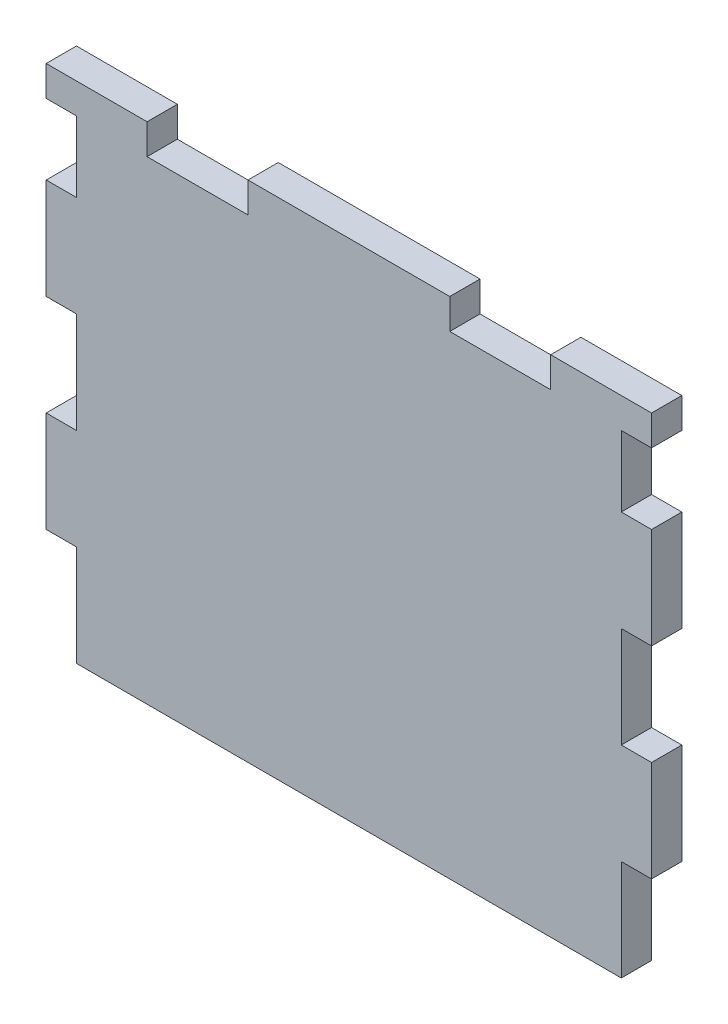
ISO-10303-21;
HEADER;
FILE_DESCRIPTION(('STEP AP214'),'2;1');
FILE_NAME('part.step','',(''),(''),'','','');
FILE_SCHEMA(('AUTOMOTIVE_DESIGN { 1 0 10303 214 1 1 1 1 }'));
ENDSEC;
DATA;
#1=APPLICATION_CONTEXT('core data for automotive mechanical design processes');
#2=APPLICATION_PROTOCOL_DEFINITION('international standard','automotive_design',2000,#1);
#3=PRODUCT_CONTEXT('',#1,'mechanical');
#4=PRODUCT('Part','Part','',(#3));
#5=PRODUCT_RELATED_PRODUCT_CATEGORY('part','',(#4));
#6=PRODUCT_DEFINITION_FORMATION('','',#4);
#7=PRODUCT_DEFINITION_CONTEXT('part definition',#1,'design');
#8=PRODUCT_DEFINITION('design','',#6,#7);
#9=PRODUCT_DEFINITION_SHAPE('','',#8);
#10=(LENGTH_UNIT() NAMED_UNIT(*) SI_UNIT(.MILLI.,.METRE.));
#11=(NAMED_UNIT(*) PLANE_ANGLE_UNIT() SI_UNIT($,.RADIAN.));
#12=(NAMED_UNIT(*) SI_UNIT($,.STERADIAN.) SOLID_ANGLE_UNIT());
#13=UNCERTAINTY_MEASURE_WITH_UNIT(LENGTH_MEASURE(1.E-05),#10,'distance_accuracy_value','');
#14=(GEOMETRIC_REPRESENTATION_CONTEXT(3) GLOBAL_UNCERTAINTY_ASSIGNED_CONTEXT((#13)) GLOBAL_UNIT_ASSIGNED_CONTEXT((#10,
#11,#12)) REPRESENTATION_CONTEXT('',''));
#15=CARTESIAN_POINT('',(0.,0.,0.));
#16=DIRECTION('',(0.,0.,1.));
#17=DIRECTION('',(1.,0.,0.));
#18=AXIS2_PLACEMENT_3D('',#15,#16,#17);
#19=CARTESIAN_POINT('',(-30.,-25.,3.));
#20=DIRECTION('',(0.,1.,0.));
#21=DIRECTION('',(0.,0.,1.));
#22=AXIS2_PLACEMENT_3D('',#19,#20,#21);
#23=PLANE('',#22);
#24=DIRECTION('',(1.,0.,0.));
#25=VECTOR('',#24,1.);
#26=CARTESIAN_POINT('',(-30.,-25.,3.));
#27=LINE('',#26,#25);
#28=CARTESIAN_POINT('',(-26.9999999999999,-25.0000000000001,3.00000000000097));
#29=VERTEX_POINT('',#28);
#30=CARTESIAN_POINT('',(26.9999999999997,-24.9999999999999,3.00000000000097));
#31=VERTEX_POINT('',#30);
#32=EDGE_CURVE('E251',#29,#31,#27,.T.);
#33=ORIENTED_EDGE('',*,*,#32,.F.);
#34=DIRECTION('',(0.,0.,-1.));
#35=VECTOR('',#34,1.);
#36=CARTESIAN_POINT('',(-26.9999999999999,-25.,-1.14491749414469E-13));
#37=LINE('',#36,#35);
#38=CARTESIAN_POINT('',(-26.9999999999999,-25.,-1.14491749414469E-13));
#39=VERTEX_POINT('',#38);
#40=EDGE_CURVE('E261',#29,#39,#37,.T.);
#41=ORIENTED_EDGE('',*,*,#40,.T.);
#42=DIRECTION('',(1.,0.,0.));
#43=VECTOR('',#42,1.);
#44=CARTESIAN_POINT('',(-30.,-25.,0.));
#45=LINE('',#44,#43);
#46=CARTESIAN_POINT('',(27.0000000000001,-24.9999999999999,-1.14491749414469E-13));
#47=VERTEX_POINT('',#46);
#48=EDGE_CURVE('E299',#39,#47,#45,.T.);
#49=ORIENTED_EDGE('',*,*,#48,.T.);
#50=DIRECTION('',(0.,0.,-1.));
#51=VECTOR('',#50,1.);
#52=CARTESIAN_POINT('',(27.0000000000001,-24.9999999999999,-1.14491749414469E-13));
#53=LINE('',#52,#51);
#54=EDGE_CURVE('E272',#31,#47,#53,.T.);
#55=ORIENTED_EDGE('',*,*,#54,.F.);
#56=EDGE_LOOP('',(#33,#41,#49,#55));
#57=FACE_BOUND('',#56,.T.);
#58=ADVANCED_FACE('F37',(#57),#23,.F.);
#59=CARTESIAN_POINT('',(30.,-25.,3.));
#60=DIRECTION('',(-1.,0.,0.));
#61=DIRECTION('',(0.,0.,1.));
#62=AXIS2_PLACEMENT_3D('',#59,#60,#61);
#63=PLANE('',#62);
#64=DIRECTION('',(0.,1.,0.));
#65=VECTOR('',#64,1.);
#66=CARTESIAN_POINT('',(30.,-25.,3.));
#67=LINE('',#66,#65);
#68=CARTESIAN_POINT('',(30.0000000000001,-14.9999999999999,2.99999999999993));
#69=VERTEX_POINT('',#68);
#70=CARTESIAN_POINT('',(30.,-4.99999999999986,2.99999999999996));
#71=VERTEX_POINT('',#70);
#72=EDGE_CURVE('E392',#69,#71,#67,.T.);
#73=ORIENTED_EDGE('',*,*,#72,.F.);
#74=DIRECTION('',(0.,0.,-1.));
#75=VECTOR('',#74,1.);
#76=CARTESIAN_POINT('',(30.0000000000001,-14.9999999999999,0.));
#77=LINE('',#76,#75);
#78=CARTESIAN_POINT('',(30.0000000000001,-14.9999999999999,0.));
#79=VERTEX_POINT('',#78);
#80=EDGE_CURVE('E453',#69,#79,#77,.T.);
#81=ORIENTED_EDGE('',*,*,#80,.T.);
#82=DIRECTION('',(0.,1.,0.));
#83=VECTOR('',#82,1.);
#84=CARTESIAN_POINT('',(30.,-25.,0.));
#85=LINE('',#84,#83);
#86=CARTESIAN_POINT('',(30.,-4.99999999999985,0.));
#87=VERTEX_POINT('',#86);
#88=EDGE_CURVE('E289',#79,#87,#85,.T.);
#89=ORIENTED_EDGE('',*,*,#88,.T.);
#90=DIRECTION('',(0.,0.,1.));
#91=VECTOR('',#90,1.);
#92=CARTESIAN_POINT('',(30.,-4.99999999999985,0.));
#93=LINE('',#92,#91);
#94=EDGE_CURVE('E450',#87,#71,#93,.T.);
#95=ORIENTED_EDGE('',*,*,#94,.T.);
#96=EDGE_LOOP('',(#73,#81,#89,#95));
#97=FACE_BOUND('',#96,.T.);
#98=ADVANCED_FACE('F550',(#97),#63,.F.);
#99=CARTESIAN_POINT('',(30.,5.00000000000014,3.));
#100=VERTEX_POINT('',#99);
#101=CARTESIAN_POINT('',(30.,15.0000000000001,3.00000000000003));
#102=VERTEX_POINT('',#101);
#103=EDGE_CURVE('E391',#100,#102,#67,.T.);
#104=ORIENTED_EDGE('',*,*,#103,.F.);
#105=DIRECTION('',(0.,0.,-1.));
#106=VECTOR('',#105,1.);
#107=CARTESIAN_POINT('',(30.,5.00000000000015,0.));
#108=LINE('',#107,#106);
#109=CARTESIAN_POINT('',(30.,5.00000000000015,0.));
#110=VERTEX_POINT('',#109);
#111=EDGE_CURVE('E414',#100,#110,#108,.T.);
#112=ORIENTED_EDGE('',*,*,#111,.T.);
#113=CARTESIAN_POINT('',(30.,15.0000000000001,0.));
#114=VERTEX_POINT('',#113);
#115=EDGE_CURVE('E287',#110,#114,#85,.T.);
#116=ORIENTED_EDGE('',*,*,#115,.T.);
#117=DIRECTION('',(0.,0.,1.));
#118=VECTOR('',#117,1.);
#119=CARTESIAN_POINT('',(30.,15.0000000000001,0.));
#120=LINE('',#119,#118);
#121=EDGE_CURVE('E416',#114,#102,#120,.T.);
#122=ORIENTED_EDGE('',*,*,#121,.T.);
#123=EDGE_LOOP('',(#104,#112,#116,#122));
#124=FACE_BOUND('',#123,.T.);
#125=ADVANCED_FACE('F412',(#124),#63,.F.);
#126=CARTESIAN_POINT('',(-30.,-25.,3.));
#127=DIRECTION('',(1.,0.,0.));
#128=DIRECTION('',(0.,0.,-1.));
#129=AXIS2_PLACEMENT_3D('',#126,#127,#128);
#130=PLANE('',#129);
#131=DIRECTION('',(0.,0.,-1.));
#132=VECTOR('',#131,1.);
#133=CARTESIAN_POINT('',(-30.,21.9999999999999,0.));
#134=LINE('',#133,#132);
#135=CARTESIAN_POINT('',(-30.,21.9999999999999,3.));
#136=VERTEX_POINT('',#135);
#137=CARTESIAN_POINT('',(-30.,21.9999999999999,0.));
#138=VERTEX_POINT('',#137);
#139=EDGE_CURVE('E433',#136,#138,#134,.T.);
#140=ORIENTED_EDGE('',*,*,#139,.F.);
#141=DIRECTION('',(0.,-1.,0.));
#142=VECTOR('',#141,1.);
#143=CARTESIAN_POINT('',(-30.,-25.,3.));
#144=LINE('',#143,#142);
#145=CARTESIAN_POINT('',(-30.,25.,3.));
#146=VERTEX_POINT('',#145);
#147=EDGE_CURVE('E274',#146,#136,#144,.T.);
#148=ORIENTED_EDGE('',*,*,#147,.F.);
#149=DIRECTION('',(0.,0.,-1.));
#150=VECTOR('',#149,1.);
#151=CARTESIAN_POINT('',(-30.,25.,3.));
#152=LINE('',#151,#150);
#153=CARTESIAN_POINT('',(-30.,25.,0.));
#154=VERTEX_POINT('',#153);
#155=EDGE_CURVE('E273',#146,#154,#152,.T.);
#156=ORIENTED_EDGE('',*,*,#155,.T.);
#157=DIRECTION('',(0.,-1.,0.));
#158=VECTOR('',#157,1.);
#159=CARTESIAN_POINT('',(-30.,-25.,0.));
#160=LINE('',#159,#158);
#161=EDGE_CURVE('E296',#154,#138,#160,.T.);
#162=ORIENTED_EDGE('',*,*,#161,.T.);
#163=EDGE_LOOP('',(#140,#148,#156,#162));
#164=FACE_BOUND('',#163,.T.);
#165=ADVANCED_FACE('F560',(#164),#130,.F.);
#166=DIRECTION('',(0.,0.,1.));
#167=VECTOR('',#166,1.);
#168=CARTESIAN_POINT('',(-30.,14.9999999999999,0.));
#169=LINE('',#168,#167);
#170=CARTESIAN_POINT('',(-30.,14.9999999999999,0.));
#171=VERTEX_POINT('',#170);
#172=CARTESIAN_POINT('',(-30.,14.9999999999999,3.00000000000003));
#173=VERTEX_POINT('',#172);
#174=EDGE_CURVE('E472',#171,#173,#169,.T.);
#175=ORIENTED_EDGE('',*,*,#174,.F.);
#176=CARTESIAN_POINT('',(-30.,4.99999999999994,0.));
#177=VERTEX_POINT('',#176);
#178=EDGE_CURVE('E300',#171,#177,#160,.T.);
#179=ORIENTED_EDGE('',*,*,#178,.T.);
#180=DIRECTION('',(0.,0.,-1.));
#181=VECTOR('',#180,1.);
#182=CARTESIAN_POINT('',(-30.,4.99999999999994,0.));
#183=LINE('',#182,#181);
#184=CARTESIAN_POINT('',(-30.,4.99999999999993,3.));
#185=VERTEX_POINT('',#184);
#186=EDGE_CURVE('E475',#185,#177,#183,.T.);
#187=ORIENTED_EDGE('',*,*,#186,.F.);
#188=EDGE_CURVE('E280',#173,#185,#144,.T.);
#189=ORIENTED_EDGE('',*,*,#188,.F.);
#190=EDGE_LOOP('',(#175,#179,#187,#189));
#191=FACE_BOUND('',#190,.T.);
#192=ADVANCED_FACE('F531',(#191),#130,.F.);
#193=DIRECTION('',(0.,0.,1.));
#194=VECTOR('',#193,1.);
#195=CARTESIAN_POINT('',(-29.9999999999999,-5.00000000000006,0.));
#196=LINE('',#195,#194);
#197=CARTESIAN_POINT('',(-29.9999999999999,-5.00000000000006,0.));
#198=VERTEX_POINT('',#197);
#199=CARTESIAN_POINT('',(-29.9999999999999,-5.00000000000007,2.99999999999996));
#200=VERTEX_POINT('',#199);
#201=EDGE_CURVE('E489',#198,#200,#196,.T.);
#202=ORIENTED_EDGE('',*,*,#201,.F.);
#203=CARTESIAN_POINT('',(-29.9999999999999,-15.0000000000001,0.));
#204=VERTEX_POINT('',#203);
#205=EDGE_CURVE('E293',#198,#204,#160,.T.);
#206=ORIENTED_EDGE('',*,*,#205,.T.);
#207=DIRECTION('',(0.,0.,-1.));
#208=VECTOR('',#207,1.);
#209=CARTESIAN_POINT('',(-29.9999999999999,-15.0000000000001,0.));
#210=LINE('',#209,#208);
#211=CARTESIAN_POINT('',(-29.9999999999999,-15.0000000000001,2.99999999999993));
#212=VERTEX_POINT('',#211);
#213=EDGE_CURVE('E492',#212,#204,#210,.T.);
#214=ORIENTED_EDGE('',*,*,#213,.F.);
#215=EDGE_CURVE('E282',#200,#212,#144,.T.);
#216=ORIENTED_EDGE('',*,*,#215,.F.);
#217=EDGE_LOOP('',(#202,#206,#214,#216));
#218=FACE_BOUND('',#217,.T.);
#219=ADVANCED_FACE('F536',(#218),#130,.F.);
#220=CARTESIAN_POINT('',(0.,0.,3.));
#221=DIRECTION('',(0.,0.,-1.));
#222=DIRECTION('',(-1.,0.,0.));
#223=AXIS2_PLACEMENT_3D('',#220,#221,#222);
#224=PLANE('',#223);
#225=DIRECTION('',(0.,1.,0.));
#226=VECTOR('',#225,1.);
#227=CARTESIAN_POINT('',(-27.,0.,3.));
#228=LINE('',#227,#226);
#229=CARTESIAN_POINT('',(-26.9999999999999,-15.0000000000001,2.99999999999993));
#230=VERTEX_POINT('',#229);
#231=EDGE_CURVE('E246',#29,#230,#228,.T.);
#232=ORIENTED_EDGE('',*,*,#231,.F.);
#233=ORIENTED_EDGE('',*,*,#32,.T.);
#234=DIRECTION('',(0.,1.,0.));
#235=VECTOR('',#234,1.);
#236=CARTESIAN_POINT('',(27.,0.,3.));
#237=LINE('',#236,#235);
#238=CARTESIAN_POINT('',(27.0000000000001,-14.9999999999999,3.));
#239=VERTEX_POINT('',#238);
#240=EDGE_CURVE('E329',#31,#239,#237,.T.);
#241=ORIENTED_EDGE('',*,*,#240,.T.);
#242=DIRECTION('',(1.,0.,0.));
#243=VECTOR('',#242,1.);
#244=CARTESIAN_POINT('',(27.0000000000001,-14.9999999999999,2.99999999999993));
#245=LINE('',#244,#243);
#246=EDGE_CURVE('E465',#239,#69,#245,.T.);
#247=ORIENTED_EDGE('',*,*,#246,.T.);
#248=ORIENTED_EDGE('',*,*,#72,.T.);
#249=DIRECTION('',(1.,0.,0.));
#250=VECTOR('',#249,1.);
#251=CARTESIAN_POINT('',(27.,-4.99999999999987,2.99999999999996));
#252=LINE('',#251,#250);
#253=CARTESIAN_POINT('',(27.,-4.99999999999987,2.99999999999996));
#254=VERTEX_POINT('',#253);
#255=EDGE_CURVE('E467',#254,#71,#252,.T.);
#256=ORIENTED_EDGE('',*,*,#255,.F.);
#257=CARTESIAN_POINT('',(27.,5.00000000000013,3.));
#258=VERTEX_POINT('',#257);
#259=EDGE_CURVE('E327',#254,#258,#237,.T.);
#260=ORIENTED_EDGE('',*,*,#259,.T.);
#261=DIRECTION('',(1.,0.,0.));
#262=VECTOR('',#261,1.);
#263=CARTESIAN_POINT('',(27.,5.00000000000013,3.));
#264=LINE('',#263,#262);
#265=EDGE_CURVE('E408',#258,#100,#264,.T.);
#266=ORIENTED_EDGE('',*,*,#265,.T.);
#267=ORIENTED_EDGE('',*,*,#103,.T.);
#268=DIRECTION('',(1.,0.,0.));
#269=VECTOR('',#268,1.);
#270=CARTESIAN_POINT('',(27.,15.0000000000001,3.00000000000003));
#271=LINE('',#270,#269);
#272=CARTESIAN_POINT('',(27.,15.0000000000001,3.00000000000003));
#273=VERTEX_POINT('',#272);
#274=EDGE_CURVE('E326',#273,#102,#271,.T.);
#275=ORIENTED_EDGE('',*,*,#274,.F.);
#276=CARTESIAN_POINT('',(27.,22.0000000000001,3.));
#277=VERTEX_POINT('',#276);
#278=EDGE_CURVE('E317',#273,#277,#237,.T.);
#279=ORIENTED_EDGE('',*,*,#278,.T.);
#280=DIRECTION('',(-1.,0.,0.));
#281=VECTOR('',#280,1.);
#282=CARTESIAN_POINT('',(0.,22.,3.));
#283=LINE('',#282,#281);
#284=CARTESIAN_POINT('',(30.,22.0000000000001,3.));
#285=VERTEX_POINT('',#284);
#286=EDGE_CURVE('E45',#285,#277,#283,.T.);
#287=ORIENTED_EDGE('',*,*,#286,.F.);
#288=CARTESIAN_POINT('',(30.,25.,3.));
#289=VERTEX_POINT('',#288);
#290=EDGE_CURVE('E301',#285,#289,#67,.T.);
#291=ORIENTED_EDGE('',*,*,#290,.T.);
#292=DIRECTION('',(-1.,0.,0.));
#293=VECTOR('',#292,1.);
#294=CARTESIAN_POINT('',(-30.,25.,3.));
#295=LINE('',#294,#293);
#296=CARTESIAN_POINT('',(20.,25.,3.));
#297=VERTEX_POINT('',#296);
#298=EDGE_CURVE('E393',#289,#297,#295,.T.);
#299=ORIENTED_EDGE('',*,*,#298,.T.);
#300=DIRECTION('',(0.,1.,0.));
#301=VECTOR('',#300,1.);
#302=CARTESIAN_POINT('',(20.,25.,3.));
#303=LINE('',#302,#301);
#304=CARTESIAN_POINT('',(20.,22.,3.));
#305=VERTEX_POINT('',#304);
#306=EDGE_CURVE('E376',#305,#297,#303,.T.);
#307=ORIENTED_EDGE('',*,*,#306,.F.);
#308=DIRECTION('',(1.,0.,0.));
#309=VECTOR('',#308,1.);
#310=CARTESIAN_POINT('',(10.,22.,3.));
#311=LINE('',#310,#309);
#312=CARTESIAN_POINT('',(10.,22.,3.));
#313=VERTEX_POINT('',#312);
#314=EDGE_CURVE('E378',#313,#305,#311,.T.);
#315=ORIENTED_EDGE('',*,*,#314,.F.);
#316=DIRECTION('',(0.,-1.,0.));
#317=VECTOR('',#316,1.);
#318=CARTESIAN_POINT('',(9.99999999999999,25.,3.));
#319=LINE('',#318,#317);
#320=CARTESIAN_POINT('',(9.99999999999999,25.,3.));
#321=VERTEX_POINT('',#320);
#322=EDGE_CURVE('E356',#321,#313,#319,.T.);
#323=ORIENTED_EDGE('',*,*,#322,.F.);
#324=CARTESIAN_POINT('',(-10.,25.,3.));
#325=VERTEX_POINT('',#324);
#326=EDGE_CURVE('E395',#321,#325,#295,.T.);
#327=ORIENTED_EDGE('',*,*,#326,.T.);
#328=DIRECTION('',(0.,1.,0.));
#329=VECTOR('',#328,1.);
#330=CARTESIAN_POINT('',(-10.,25.,3.));
#331=LINE('',#330,#329);
#332=CARTESIAN_POINT('',(-10.,22.,3.));
#333=VERTEX_POINT('',#332);
#334=EDGE_CURVE('E345',#333,#325,#331,.T.);
#335=ORIENTED_EDGE('',*,*,#334,.F.);
#336=DIRECTION('',(1.,0.,0.));
#337=VECTOR('',#336,1.);
#338=CARTESIAN_POINT('',(-20.,22.,3.));
#339=LINE('',#338,#337);
#340=CARTESIAN_POINT('',(-20.,22.,3.));
#341=VERTEX_POINT('',#340);
#342=EDGE_CURVE('E355',#341,#333,#339,.T.);
#343=ORIENTED_EDGE('',*,*,#342,.F.);
#344=DIRECTION('',(0.,-1.,0.));
#345=VECTOR('',#344,1.);
#346=CARTESIAN_POINT('',(-20.,25.,3.));
#347=LINE('',#346,#345);
#348=CARTESIAN_POINT('',(-20.,25.,3.));
#349=VERTEX_POINT('',#348);
#350=EDGE_CURVE('E352',#349,#341,#347,.T.);
#351=ORIENTED_EDGE('',*,*,#350,.F.);
#352=EDGE_CURVE('E396',#349,#146,#295,.T.);
#353=ORIENTED_EDGE('',*,*,#352,.T.);
#354=ORIENTED_EDGE('',*,*,#147,.T.);
#355=DIRECTION('',(-1.,0.,0.));
#356=VECTOR('',#355,1.);
#357=CARTESIAN_POINT('',(0.,22.,3.));
#358=LINE('',#357,#356);
#359=CARTESIAN_POINT('',(-27.,21.9999999999999,3.));
#360=VERTEX_POINT('',#359);
#361=EDGE_CURVE('E11',#360,#136,#358,.T.);
#362=ORIENTED_EDGE('',*,*,#361,.F.);
#363=CARTESIAN_POINT('',(-27.,14.9999999999999,3.00000000000003));
#364=VERTEX_POINT('',#363);
#365=EDGE_CURVE('E259',#364,#360,#228,.T.);
#366=ORIENTED_EDGE('',*,*,#365,.F.);
#367=DIRECTION('',(1.,0.,0.));
#368=VECTOR('',#367,1.);
#369=CARTESIAN_POINT('',(-30.,14.9999999999999,3.00000000000003));
#370=LINE('',#369,#368);
#371=EDGE_CURVE('E485',#173,#364,#370,.T.);
#372=ORIENTED_EDGE('',*,*,#371,.F.);
#373=ORIENTED_EDGE('',*,*,#188,.T.);
#374=DIRECTION('',(1.,0.,0.));
#375=VECTOR('',#374,1.);
#376=CARTESIAN_POINT('',(-30.,4.99999999999993,3.));
#377=LINE('',#376,#375);
#378=CARTESIAN_POINT('',(-27.,4.99999999999994,3.));
#379=VERTEX_POINT('',#378);
#380=EDGE_CURVE('E481',#185,#379,#377,.T.);
#381=ORIENTED_EDGE('',*,*,#380,.T.);
#382=CARTESIAN_POINT('',(-26.9999999999999,-5.00000000000006,2.99999999999996));
#383=VERTEX_POINT('',#382);
#384=EDGE_CURVE('E257',#383,#379,#228,.T.);
#385=ORIENTED_EDGE('',*,*,#384,.F.);
#386=DIRECTION('',(1.,0.,0.));
#387=VECTOR('',#386,1.);
#388=CARTESIAN_POINT('',(-29.9999999999999,-5.00000000000007,2.99999999999996));
#389=LINE('',#388,#387);
#390=EDGE_CURVE('E503',#200,#383,#389,.T.);
#391=ORIENTED_EDGE('',*,*,#390,.F.);
#392=ORIENTED_EDGE('',*,*,#215,.T.);
#393=DIRECTION('',(1.,0.,0.));
#394=VECTOR('',#393,1.);
#395=CARTESIAN_POINT('',(-29.9999999999999,-15.0000000000001,2.99999999999993));
#396=LINE('',#395,#394);
#397=EDGE_CURVE('E253',#212,#230,#396,.T.);
#398=ORIENTED_EDGE('',*,*,#397,.T.);
#399=EDGE_LOOP('',(#232,#233,#241,#247,#248,#256,#260,#266,#267,#275,#279,#287,#291,#299,#307,
#315,#323,#327,#335,#343,#351,#353,#354,#362,#366,#372,#373,#381,#385,#391,#392,#398));
#400=FACE_BOUND('',#399,.T.);
#401=ADVANCED_FACE('F248',(#400),#224,.F.);
#402=CARTESIAN_POINT('',(0.,0.,0.));
#403=DIRECTION('',(0.,0.,-1.));
#404=DIRECTION('',(-1.,0.,0.));
#405=AXIS2_PLACEMENT_3D('',#402,#403,#404);
#406=PLANE('',#405);
#407=DIRECTION('',(1.,0.,0.));
#408=VECTOR('',#407,1.);
#409=CARTESIAN_POINT('',(-29.9999999999999,-15.0000000000001,0.));
#410=LINE('',#409,#408);
#411=CARTESIAN_POINT('',(-26.9999999999999,-15.0000000000001,0.));
#412=VERTEX_POINT('',#411);
#413=EDGE_CURVE('E498',#204,#412,#410,.T.);
#414=ORIENTED_EDGE('',*,*,#413,.F.);
#415=ORIENTED_EDGE('',*,*,#205,.F.);
#416=DIRECTION('',(1.,0.,0.));
#417=VECTOR('',#416,1.);
#418=CARTESIAN_POINT('',(-29.9999999999999,-5.00000000000006,0.));
#419=LINE('',#418,#417);
#420=CARTESIAN_POINT('',(-26.9999999999999,-5.00000000000005,0.));
#421=VERTEX_POINT('',#420);
#422=EDGE_CURVE('E494',#198,#421,#419,.T.);
#423=ORIENTED_EDGE('',*,*,#422,.T.);
#424=DIRECTION('',(0.,1.,0.));
#425=VECTOR('',#424,1.);
#426=CARTESIAN_POINT('',(-26.9999999999999,-25.,-1.14491749414469E-13));
#427=LINE('',#426,#425);
#428=CARTESIAN_POINT('',(-27.,4.99999999999995,0.));
#429=VERTEX_POINT('',#428);
#430=EDGE_CURVE('E331',#421,#429,#427,.T.);
#431=ORIENTED_EDGE('',*,*,#430,.T.);
#432=DIRECTION('',(1.,0.,0.));
#433=VECTOR('',#432,1.);
#434=CARTESIAN_POINT('',(-30.,4.99999999999994,0.));
#435=LINE('',#434,#433);
#436=EDGE_CURVE('E60',#177,#429,#435,.T.);
#437=ORIENTED_EDGE('',*,*,#436,.F.);
#438=ORIENTED_EDGE('',*,*,#178,.F.);
#439=DIRECTION('',(1.,0.,0.));
#440=VECTOR('',#439,1.);
#441=CARTESIAN_POINT('',(-30.,14.9999999999999,0.));
#442=LINE('',#441,#440);
#443=CARTESIAN_POINT('',(-27.,14.9999999999999,0.));
#444=VERTEX_POINT('',#443);
#445=EDGE_CURVE('E477',#171,#444,#442,.T.);
#446=ORIENTED_EDGE('',*,*,#445,.T.);
#447=CARTESIAN_POINT('',(-27.,22.,0.));
#448=VERTEX_POINT('',#447);
#449=EDGE_CURVE('E268',#444,#448,#427,.T.);
#450=ORIENTED_EDGE('',*,*,#449,.T.);
#451=DIRECTION('',(1.,0.,0.));
#452=VECTOR('',#451,1.);
#453=CARTESIAN_POINT('',(-30.,21.9999999999999,0.));
#454=LINE('',#453,#452);
#455=EDGE_CURVE('E429',#138,#448,#454,.T.);
#456=ORIENTED_EDGE('',*,*,#455,.F.);
#457=ORIENTED_EDGE('',*,*,#161,.F.);
#458=DIRECTION('',(-1.,0.,0.));
#459=VECTOR('',#458,1.);
#460=CARTESIAN_POINT('',(-30.,25.,0.));
#461=LINE('',#460,#459);
#462=CARTESIAN_POINT('',(-20.,25.,0.));
#463=VERTEX_POINT('',#462);
#464=EDGE_CURVE('E295',#463,#154,#461,.T.);
#465=ORIENTED_EDGE('',*,*,#464,.F.);
#466=DIRECTION('',(0.,-1.,0.));
#467=VECTOR('',#466,1.);
#468=CARTESIAN_POINT('',(-20.,25.,0.));
#469=LINE('',#468,#467);
#470=CARTESIAN_POINT('',(-20.,22.,0.));
#471=VERTEX_POINT('',#470);
#472=EDGE_CURVE('E341',#463,#471,#469,.T.);
#473=ORIENTED_EDGE('',*,*,#472,.T.);
#474=DIRECTION('',(1.,0.,0.));
#475=VECTOR('',#474,1.);
#476=CARTESIAN_POINT('',(-20.,22.,0.));
#477=LINE('',#476,#475);
#478=CARTESIAN_POINT('',(-10.,22.,0.));
#479=VERTEX_POINT('',#478);
#480=EDGE_CURVE('E344',#471,#479,#477,.T.);
#481=ORIENTED_EDGE('',*,*,#480,.T.);
#482=DIRECTION('',(0.,1.,0.));
#483=VECTOR('',#482,1.);
#484=CARTESIAN_POINT('',(-10.,25.,0.));
#485=LINE('',#484,#483);
#486=CARTESIAN_POINT('',(-10.,25.,0.));
#487=VERTEX_POINT('',#486);
#488=EDGE_CURVE('E348',#479,#487,#485,.T.);
#489=ORIENTED_EDGE('',*,*,#488,.T.);
#490=CARTESIAN_POINT('',(9.99999999999999,25.,0.));
#491=VERTEX_POINT('',#490);
#492=EDGE_CURVE('E294',#491,#487,#461,.T.);
#493=ORIENTED_EDGE('',*,*,#492,.F.);
#494=DIRECTION('',(0.,-1.,0.));
#495=VECTOR('',#494,1.);
#496=CARTESIAN_POINT('',(9.99999999999999,25.,0.));
#497=LINE('',#496,#495);
#498=CARTESIAN_POINT('',(10.,22.,0.));
#499=VERTEX_POINT('',#498);
#500=EDGE_CURVE('E379',#491,#499,#497,.T.);
#501=ORIENTED_EDGE('',*,*,#500,.T.);
#502=DIRECTION('',(1.,0.,0.));
#503=VECTOR('',#502,1.);
#504=CARTESIAN_POINT('',(10.,22.,0.));
#505=LINE('',#504,#503);
#506=CARTESIAN_POINT('',(20.,22.,0.));
#507=VERTEX_POINT('',#506);
#508=EDGE_CURVE('E386',#499,#507,#505,.T.);
#509=ORIENTED_EDGE('',*,*,#508,.T.);
#510=DIRECTION('',(0.,1.,0.));
#511=VECTOR('',#510,1.);
#512=CARTESIAN_POINT('',(20.,25.,0.));
#513=LINE('',#512,#511);
#514=CARTESIAN_POINT('',(20.,25.,0.));
#515=VERTEX_POINT('',#514);
#516=EDGE_CURVE('E369',#507,#515,#513,.T.);
#517=ORIENTED_EDGE('',*,*,#516,.T.);
#518=CARTESIAN_POINT('',(30.,25.,0.));
#519=VERTEX_POINT('',#518);
#520=EDGE_CURVE('E290',#519,#515,#461,.T.);
#521=ORIENTED_EDGE('',*,*,#520,.F.);
#522=CARTESIAN_POINT('',(30.,22.0000000000002,0.));
#523=VERTEX_POINT('',#522);
#524=EDGE_CURVE('E285',#523,#519,#85,.T.);
#525=ORIENTED_EDGE('',*,*,#524,.F.);
#526=DIRECTION('',(1.,0.,0.));
#527=VECTOR('',#526,1.);
#528=CARTESIAN_POINT('',(27.,22.0000000000001,0.));
#529=LINE('',#528,#527);
#530=CARTESIAN_POINT('',(27.,22.0000000000001,0.));
#531=VERTEX_POINT('',#530);
#532=EDGE_CURVE('E322',#531,#523,#529,.T.);
#533=ORIENTED_EDGE('',*,*,#532,.F.);
#534=DIRECTION('',(0.,1.,0.));
#535=VECTOR('',#534,1.);
#536=CARTESIAN_POINT('',(27.0000000000001,-24.9999999999999,-1.14491749414469E-13));
#537=LINE('',#536,#535);
#538=CARTESIAN_POINT('',(27.,15.0000000000001,0.));
#539=VERTEX_POINT('',#538);
#540=EDGE_CURVE('E320',#539,#531,#537,.T.);
#541=ORIENTED_EDGE('',*,*,#540,.F.);
#542=DIRECTION('',(1.,0.,0.));
#543=VECTOR('',#542,1.);
#544=CARTESIAN_POINT('',(27.,15.0000000000001,0.));
#545=LINE('',#544,#543);
#546=EDGE_CURVE('E427',#539,#114,#545,.T.);
#547=ORIENTED_EDGE('',*,*,#546,.T.);
#548=ORIENTED_EDGE('',*,*,#115,.F.);
#549=DIRECTION('',(1.,0.,0.));
#550=VECTOR('',#549,1.);
#551=CARTESIAN_POINT('',(27.,5.00000000000014,0.));
#552=LINE('',#551,#550);
#553=CARTESIAN_POINT('',(27.,5.00000000000014,0.));
#554=VERTEX_POINT('',#553);
#555=EDGE_CURVE('E446',#554,#110,#552,.T.);
#556=ORIENTED_EDGE('',*,*,#555,.F.);
#557=CARTESIAN_POINT('',(27.,-4.99999999999986,0.));
#558=VERTEX_POINT('',#557);
#559=EDGE_CURVE('E430',#558,#554,#537,.T.);
#560=ORIENTED_EDGE('',*,*,#559,.F.);
#561=DIRECTION('',(1.,0.,0.));
#562=VECTOR('',#561,1.);
#563=CARTESIAN_POINT('',(27.,-4.99999999999986,0.));
#564=LINE('',#563,#562);
#565=EDGE_CURVE('E459',#558,#87,#564,.T.);
#566=ORIENTED_EDGE('',*,*,#565,.T.);
#567=ORIENTED_EDGE('',*,*,#88,.F.);
#568=DIRECTION('',(1.,0.,0.));
#569=VECTOR('',#568,1.);
#570=CARTESIAN_POINT('',(27.0000000000001,-14.9999999999999,0.));
#571=LINE('',#570,#569);
#572=CARTESIAN_POINT('',(27.0000000000001,-14.9999999999999,0.));
#573=VERTEX_POINT('',#572);
#574=EDGE_CURVE('E463',#573,#79,#571,.T.);
#575=ORIENTED_EDGE('',*,*,#574,.F.);
#576=EDGE_CURVE('E428',#47,#573,#537,.T.);
#577=ORIENTED_EDGE('',*,*,#576,.F.);
#578=ORIENTED_EDGE('',*,*,#48,.F.);
#579=EDGE_CURVE('E264',#39,#412,#427,.T.);
#580=ORIENTED_EDGE('',*,*,#579,.T.);
#581=EDGE_LOOP('',(#414,#415,#423,#431,#437,#438,#446,#450,#456,#457,#465,#473,#481,#489,#493,
#501,#509,#517,#521,#525,#533,#541,#547,#548,#556,#560,#566,#567,#575,#577,#578,#580));
#582=FACE_BOUND('',#581,.T.);
#583=ADVANCED_FACE('F448',(#582),#406,.T.);
#584=CARTESIAN_POINT('',(-30.,25.,3.));
#585=DIRECTION('',(0.,-1.,0.));
#586=DIRECTION('',(0.,0.,-1.));
#587=AXIS2_PLACEMENT_3D('',#584,#585,#586);
#588=PLANE('',#587);
#589=ORIENTED_EDGE('',*,*,#352,.F.);
#590=DIRECTION('',(0.,0.,1.));
#591=VECTOR('',#590,1.);
#592=CARTESIAN_POINT('',(-20.,25.,0.));
#593=LINE('',#592,#591);
#594=EDGE_CURVE('E288',#463,#349,#593,.T.);
#595=ORIENTED_EDGE('',*,*,#594,.F.);
#596=ORIENTED_EDGE('',*,*,#464,.T.);
#597=ORIENTED_EDGE('',*,*,#155,.F.);
#598=EDGE_LOOP('',(#589,#595,#596,#597));
#599=FACE_BOUND('',#598,.T.);
#600=ADVANCED_FACE('F567',(#599),#588,.F.);
#601=ORIENTED_EDGE('',*,*,#492,.T.);
#602=DIRECTION('',(0.,0.,1.));
#603=VECTOR('',#602,1.);
#604=CARTESIAN_POINT('',(-10.,25.,0.));
#605=LINE('',#604,#603);
#606=EDGE_CURVE('E361',#487,#325,#605,.T.);
#607=ORIENTED_EDGE('',*,*,#606,.T.);
#608=ORIENTED_EDGE('',*,*,#326,.F.);
#609=DIRECTION('',(0.,0.,1.));
#610=VECTOR('',#609,1.);
#611=CARTESIAN_POINT('',(9.99999999999999,25.,0.));
#612=LINE('',#611,#610);
#613=EDGE_CURVE('E256',#491,#321,#612,.T.);
#614=ORIENTED_EDGE('',*,*,#613,.F.);
#615=EDGE_LOOP('',(#601,#607,#608,#614));
#616=FACE_BOUND('',#615,.T.);
#617=ADVANCED_FACE('F568',(#616),#588,.F.);
#618=ORIENTED_EDGE('',*,*,#290,.F.);
#619=DIRECTION('',(0.,0.,-1.));
#620=VECTOR('',#619,1.);
#621=CARTESIAN_POINT('',(30.,22.0000000000002,0.));
#622=LINE('',#621,#620);
#623=EDGE_CURVE('E311',#285,#523,#622,.T.);
#624=ORIENTED_EDGE('',*,*,#623,.T.);
#625=ORIENTED_EDGE('',*,*,#524,.T.);
#626=DIRECTION('',(0.,0.,-1.));
#627=VECTOR('',#626,1.);
#628=CARTESIAN_POINT('',(30.,25.,3.));
#629=LINE('',#628,#627);
#630=EDGE_CURVE('E277',#289,#519,#629,.T.);
#631=ORIENTED_EDGE('',*,*,#630,.F.);
#632=EDGE_LOOP('',(#618,#624,#625,#631));
#633=FACE_BOUND('',#632,.T.);
#634=ADVANCED_FACE('F39',(#633),#63,.F.);
#635=ORIENTED_EDGE('',*,*,#520,.T.);
#636=DIRECTION('',(0.,0.,1.));
#637=VECTOR('',#636,1.);
#638=CARTESIAN_POINT('',(20.,25.,0.));
#639=LINE('',#638,#637);
#640=EDGE_CURVE('E372',#515,#297,#639,.T.);
#641=ORIENTED_EDGE('',*,*,#640,.T.);
#642=ORIENTED_EDGE('',*,*,#298,.F.);
#643=ORIENTED_EDGE('',*,*,#630,.T.);
#644=EDGE_LOOP('',(#635,#641,#642,#643));
#645=FACE_BOUND('',#644,.T.);
#646=ADVANCED_FACE('F563',(#645),#588,.F.);
#647=CARTESIAN_POINT('',(9.99999999999999,25.,0.));
#648=DIRECTION('',(-1.,0.,0.));
#649=DIRECTION('',(0.,-1.,0.));
#650=AXIS2_PLACEMENT_3D('',#647,#648,#649);
#651=PLANE('',#650);
#652=ORIENTED_EDGE('',*,*,#322,.T.);
#653=DIRECTION('',(0.,0.,1.));
#654=VECTOR('',#653,1.);
#655=CARTESIAN_POINT('',(10.,22.,0.));
#656=LINE('',#655,#654);
#657=EDGE_CURVE('E367',#499,#313,#656,.T.);
#658=ORIENTED_EDGE('',*,*,#657,.F.);
#659=ORIENTED_EDGE('',*,*,#500,.F.);
#660=ORIENTED_EDGE('',*,*,#613,.T.);
#661=EDGE_LOOP('',(#652,#658,#659,#660));
#662=FACE_BOUND('',#661,.T.);
#663=ADVANCED_FACE('F565',(#662),#651,.F.);
#664=CARTESIAN_POINT('',(20.,25.,0.));
#665=DIRECTION('',(1.,0.,0.));
#666=DIRECTION('',(0.,0.,-1.));
#667=AXIS2_PLACEMENT_3D('',#664,#665,#666);
#668=PLANE('',#667);
#669=ORIENTED_EDGE('',*,*,#306,.T.);
#670=ORIENTED_EDGE('',*,*,#640,.F.);
#671=ORIENTED_EDGE('',*,*,#516,.F.);
#672=DIRECTION('',(0.,0.,1.));
#673=VECTOR('',#672,1.);
#674=CARTESIAN_POINT('',(20.,22.,0.));
#675=LINE('',#674,#673);
#676=EDGE_CURVE('E370',#507,#305,#675,.T.);
#677=ORIENTED_EDGE('',*,*,#676,.T.);
#678=EDGE_LOOP('',(#669,#670,#671,#677));
#679=FACE_BOUND('',#678,.T.);
#680=ADVANCED_FACE('F573',(#679),#668,.F.);
#681=CARTESIAN_POINT('',(10.,22.,0.));
#682=DIRECTION('',(0.,-1.,0.));
#683=DIRECTION('',(0.,0.,-1.));
#684=AXIS2_PLACEMENT_3D('',#681,#682,#683);
#685=PLANE('',#684);
#686=ORIENTED_EDGE('',*,*,#314,.T.);
#687=ORIENTED_EDGE('',*,*,#676,.F.);
#688=ORIENTED_EDGE('',*,*,#508,.F.);
#689=ORIENTED_EDGE('',*,*,#657,.T.);
#690=EDGE_LOOP('',(#686,#687,#688,#689));
#691=FACE_BOUND('',#690,.T.);
#692=ADVANCED_FACE('F624',(#691),#685,.F.);
#693=CARTESIAN_POINT('',(-20.,25.,0.));
#694=DIRECTION('',(-1.,0.,0.));
#695=DIRECTION('',(0.,-1.,0.));
#696=AXIS2_PLACEMENT_3D('',#693,#694,#695);
#697=PLANE('',#696);
#698=ORIENTED_EDGE('',*,*,#350,.T.);
#699=DIRECTION('',(0.,0.,1.));
#700=VECTOR('',#699,1.);
#701=CARTESIAN_POINT('',(-20.,22.,0.));
#702=LINE('',#701,#700);
#703=EDGE_CURVE('E351',#471,#341,#702,.T.);
#704=ORIENTED_EDGE('',*,*,#703,.F.);
#705=ORIENTED_EDGE('',*,*,#472,.F.);
#706=ORIENTED_EDGE('',*,*,#594,.T.);
#707=EDGE_LOOP('',(#698,#704,#705,#706));
#708=FACE_BOUND('',#707,.T.);
#709=ADVANCED_FACE('F618',(#708),#697,.F.);
#710=CARTESIAN_POINT('',(-10.,25.,0.));
#711=DIRECTION('',(1.,0.,0.));
#712=DIRECTION('',(0.,0.,-1.));
#713=AXIS2_PLACEMENT_3D('',#710,#711,#712);
#714=PLANE('',#713);
#715=ORIENTED_EDGE('',*,*,#334,.T.);
#716=ORIENTED_EDGE('',*,*,#606,.F.);
#717=ORIENTED_EDGE('',*,*,#488,.F.);
#718=DIRECTION('',(0.,0.,1.));
#719=VECTOR('',#718,1.);
#720=CARTESIAN_POINT('',(-10.,22.,0.));
#721=LINE('',#720,#719);
#722=EDGE_CURVE('E364',#479,#333,#721,.T.);
#723=ORIENTED_EDGE('',*,*,#722,.T.);
#724=EDGE_LOOP('',(#715,#716,#717,#723));
#725=FACE_BOUND('',#724,.T.);
#726=ADVANCED_FACE('F614',(#725),#714,.F.);
#727=CARTESIAN_POINT('',(-20.,22.,0.));
#728=DIRECTION('',(0.,-1.,0.));
#729=DIRECTION('',(0.,0.,-1.));
#730=AXIS2_PLACEMENT_3D('',#727,#728,#729);
#731=PLANE('',#730);
#732=ORIENTED_EDGE('',*,*,#342,.T.);
#733=ORIENTED_EDGE('',*,*,#722,.F.);
#734=ORIENTED_EDGE('',*,*,#480,.F.);
#735=ORIENTED_EDGE('',*,*,#703,.T.);
#736=EDGE_LOOP('',(#732,#733,#734,#735));
#737=FACE_BOUND('',#736,.T.);
#738=ADVANCED_FACE('F617',(#737),#731,.F.);
#739=CARTESIAN_POINT('',(27.,0.,25.));
#740=DIRECTION('',(-1.,0.,0.));
#741=DIRECTION('',(0.,-1.,0.));
#742=AXIS2_PLACEMENT_3D('',#739,#740,#741);
#743=PLANE('',#742);
#744=DIRECTION('',(0.,0.,1.));
#745=VECTOR('',#744,1.);
#746=CARTESIAN_POINT('',(27.,15.0000000000001,0.));
#747=LINE('',#746,#745);
#748=EDGE_CURVE('E421',#539,#273,#747,.T.);
#749=ORIENTED_EDGE('',*,*,#748,.F.);
#750=ORIENTED_EDGE('',*,*,#540,.T.);
#751=DIRECTION('',(0.,0.,-1.));
#752=VECTOR('',#751,1.);
#753=CARTESIAN_POINT('',(27.,22.0000000000001,0.));
#754=LINE('',#753,#752);
#755=EDGE_CURVE('E308',#277,#531,#754,.T.);
#756=ORIENTED_EDGE('',*,*,#755,.F.);
#757=ORIENTED_EDGE('',*,*,#278,.F.);
#758=EDGE_LOOP('',(#749,#750,#756,#757));
#759=FACE_BOUND('',#758,.T.);
#760=ADVANCED_FACE('F316',(#759),#743,.F.);
#761=CARTESIAN_POINT('',(27.,22.0000000000001,0.));
#762=DIRECTION('',(0.,-1.,0.));
#763=DIRECTION('',(1.,0.,0.));
#764=AXIS2_PLACEMENT_3D('',#761,#762,#763);
#765=PLANE('',#764);
#766=ORIENTED_EDGE('',*,*,#286,.T.);
#767=ORIENTED_EDGE('',*,*,#755,.T.);
#768=ORIENTED_EDGE('',*,*,#532,.T.);
#769=ORIENTED_EDGE('',*,*,#623,.F.);
#770=EDGE_LOOP('',(#766,#767,#768,#769));
#771=FACE_BOUND('',#770,.T.);
#772=ADVANCED_FACE('F307',(#771),#765,.T.);
#773=CARTESIAN_POINT('',(27.,15.0000000000001,0.));
#774=DIRECTION('',(0.,1.,0.));
#775=DIRECTION('',(0.,0.,1.));
#776=AXIS2_PLACEMENT_3D('',#773,#774,#775);
#777=PLANE('',#776);
#778=ORIENTED_EDGE('',*,*,#121,.F.);
#779=ORIENTED_EDGE('',*,*,#546,.F.);
#780=ORIENTED_EDGE('',*,*,#748,.T.);
#781=ORIENTED_EDGE('',*,*,#274,.T.);
#782=EDGE_LOOP('',(#778,#779,#780,#781));
#783=FACE_BOUND('',#782,.T.);
#784=ADVANCED_FACE('F608',(#783),#777,.T.);
#785=DIRECTION('',(0.,0.,1.));
#786=VECTOR('',#785,1.);
#787=CARTESIAN_POINT('',(27.,-4.99999999999986,0.));
#788=LINE('',#787,#786);
#789=EDGE_CURVE('E443',#558,#254,#788,.T.);
#790=ORIENTED_EDGE('',*,*,#789,.F.);
#791=ORIENTED_EDGE('',*,*,#559,.T.);
#792=DIRECTION('',(0.,0.,-1.));
#793=VECTOR('',#792,1.);
#794=CARTESIAN_POINT('',(27.,5.00000000000014,0.));
#795=LINE('',#794,#793);
#796=EDGE_CURVE('E425',#258,#554,#795,.T.);
#797=ORIENTED_EDGE('',*,*,#796,.F.);
#798=ORIENTED_EDGE('',*,*,#259,.F.);
#799=EDGE_LOOP('',(#790,#791,#797,#798));
#800=FACE_BOUND('',#799,.T.);
#801=ADVANCED_FACE('F441',(#800),#743,.F.);
#802=CARTESIAN_POINT('',(27.,5.00000000000014,0.));
#803=DIRECTION('',(0.,-1.,0.));
#804=DIRECTION('',(1.,0.,0.));
#805=AXIS2_PLACEMENT_3D('',#802,#803,#804);
#806=PLANE('',#805);
#807=ORIENTED_EDGE('',*,*,#111,.F.);
#808=ORIENTED_EDGE('',*,*,#265,.F.);
#809=ORIENTED_EDGE('',*,*,#796,.T.);
#810=ORIENTED_EDGE('',*,*,#555,.T.);
#811=EDGE_LOOP('',(#807,#808,#809,#810));
#812=FACE_BOUND('',#811,.T.);
#813=ADVANCED_FACE('F594',(#812),#806,.T.);
#814=CARTESIAN_POINT('',(27.,-4.99999999999986,0.));
#815=DIRECTION('',(0.,1.,0.));
#816=DIRECTION('',(0.,0.,1.));
#817=AXIS2_PLACEMENT_3D('',#814,#815,#816);
#818=PLANE('',#817);
#819=ORIENTED_EDGE('',*,*,#94,.F.);
#820=ORIENTED_EDGE('',*,*,#565,.F.);
#821=ORIENTED_EDGE('',*,*,#789,.T.);
#822=ORIENTED_EDGE('',*,*,#255,.T.);
#823=EDGE_LOOP('',(#819,#820,#821,#822));
#824=FACE_BOUND('',#823,.T.);
#825=ADVANCED_FACE('F592',(#824),#818,.T.);
#826=CARTESIAN_POINT('',(-27.,-1.33507604489546E-13,25.));
#827=DIRECTION('',(-1.,0.,0.));
#828=DIRECTION('',(0.,-1.,0.));
#829=AXIS2_PLACEMENT_3D('',#826,#827,#828);
#830=PLANE('',#829);
#831=ORIENTED_EDGE('',*,*,#365,.T.);
#832=DIRECTION('',(0.,0.,-1.));
#833=VECTOR('',#832,1.);
#834=CARTESIAN_POINT('',(-27.,22.,0.));
#835=LINE('',#834,#833);
#836=EDGE_CURVE('E501',#360,#448,#835,.T.);
#837=ORIENTED_EDGE('',*,*,#836,.T.);
#838=ORIENTED_EDGE('',*,*,#449,.F.);
#839=DIRECTION('',(0.,0.,1.));
#840=VECTOR('',#839,1.);
#841=CARTESIAN_POINT('',(-27.,14.9999999999999,0.));
#842=LINE('',#841,#840);
#843=EDGE_CURVE('E269',#444,#364,#842,.T.);
#844=ORIENTED_EDGE('',*,*,#843,.T.);
#845=EDGE_LOOP('',(#831,#837,#838,#844));
#846=FACE_BOUND('',#845,.T.);
#847=ADVANCED_FACE('F510',(#846),#830,.T.);
#848=CARTESIAN_POINT('',(-30.,21.9999999999999,0.));
#849=DIRECTION('',(0.,-1.,0.));
#850=DIRECTION('',(1.,0.,0.));
#851=AXIS2_PLACEMENT_3D('',#848,#849,#850);
#852=PLANE('',#851);
#853=ORIENTED_EDGE('',*,*,#361,.T.);
#854=ORIENTED_EDGE('',*,*,#139,.T.);
#855=ORIENTED_EDGE('',*,*,#455,.T.);
#856=ORIENTED_EDGE('',*,*,#836,.F.);
#857=EDGE_LOOP('',(#853,#854,#855,#856));
#858=FACE_BOUND('',#857,.T.);
#859=ADVANCED_FACE('F600',(#858),#852,.T.);
#860=CARTESIAN_POINT('',(-30.,14.9999999999999,0.));
#861=DIRECTION('',(0.,1.,0.));
#862=DIRECTION('',(0.,0.,1.));
#863=AXIS2_PLACEMENT_3D('',#860,#861,#862);
#864=PLANE('',#863);
#865=ORIENTED_EDGE('',*,*,#843,.F.);
#866=ORIENTED_EDGE('',*,*,#445,.F.);
#867=ORIENTED_EDGE('',*,*,#174,.T.);
#868=ORIENTED_EDGE('',*,*,#371,.T.);
#869=EDGE_LOOP('',(#865,#866,#867,#868));
#870=FACE_BOUND('',#869,.T.);
#871=ADVANCED_FACE('F792',(#870),#864,.T.);
#872=ORIENTED_EDGE('',*,*,#384,.T.);
#873=DIRECTION('',(0.,0.,-1.));
#874=VECTOR('',#873,1.);
#875=CARTESIAN_POINT('',(-27.,4.99999999999995,0.));
#876=LINE('',#875,#874);
#877=EDGE_CURVE('E474',#379,#429,#876,.T.);
#878=ORIENTED_EDGE('',*,*,#877,.T.);
#879=ORIENTED_EDGE('',*,*,#430,.F.);
#880=DIRECTION('',(0.,0.,1.));
#881=VECTOR('',#880,1.);
#882=CARTESIAN_POINT('',(-26.9999999999999,-5.00000000000005,0.));
#883=LINE('',#882,#881);
#884=EDGE_CURVE('E482',#421,#383,#883,.T.);
#885=ORIENTED_EDGE('',*,*,#884,.T.);
#886=EDGE_LOOP('',(#872,#878,#879,#885));
#887=FACE_BOUND('',#886,.T.);
#888=ADVANCED_FACE('F521',(#887),#830,.T.);
#889=CARTESIAN_POINT('',(-30.,4.99999999999994,0.));
#890=DIRECTION('',(0.,-1.,0.));
#891=DIRECTION('',(1.,0.,0.));
#892=AXIS2_PLACEMENT_3D('',#889,#890,#891);
#893=PLANE('',#892);
#894=ORIENTED_EDGE('',*,*,#877,.F.);
#895=ORIENTED_EDGE('',*,*,#380,.F.);
#896=ORIENTED_EDGE('',*,*,#186,.T.);
#897=ORIENTED_EDGE('',*,*,#436,.T.);
#898=EDGE_LOOP('',(#894,#895,#896,#897));
#899=FACE_BOUND('',#898,.T.);
#900=ADVANCED_FACE('F523',(#899),#893,.T.);
#901=CARTESIAN_POINT('',(-29.9999999999999,-5.00000000000006,0.));
#902=DIRECTION('',(0.,1.,0.));
#903=DIRECTION('',(0.,0.,1.));
#904=AXIS2_PLACEMENT_3D('',#901,#902,#903);
#905=PLANE('',#904);
#906=ORIENTED_EDGE('',*,*,#884,.F.);
#907=ORIENTED_EDGE('',*,*,#422,.F.);
#908=ORIENTED_EDGE('',*,*,#201,.T.);
#909=ORIENTED_EDGE('',*,*,#390,.T.);
#910=EDGE_LOOP('',(#906,#907,#908,#909));
#911=FACE_BOUND('',#910,.T.);
#912=ADVANCED_FACE('F613',(#911),#905,.T.);
#913=ORIENTED_EDGE('',*,*,#240,.F.);
#914=ORIENTED_EDGE('',*,*,#54,.T.);
#915=ORIENTED_EDGE('',*,*,#576,.T.);
#916=DIRECTION('',(0.,0.,-1.));
#917=VECTOR('',#916,1.);
#918=CARTESIAN_POINT('',(27.0000000000001,-14.9999999999999,0.));
#919=LINE('',#918,#917);
#920=EDGE_CURVE('E52',#239,#573,#919,.T.);
#921=ORIENTED_EDGE('',*,*,#920,.F.);
#922=EDGE_LOOP('',(#913,#914,#915,#921));
#923=FACE_BOUND('',#922,.T.);
#924=ADVANCED_FACE('F606',(#923),#743,.F.);
#925=CARTESIAN_POINT('',(27.0000000000001,-14.9999999999999,0.));
#926=DIRECTION('',(0.,-1.,0.));
#927=DIRECTION('',(1.,0.,0.));
#928=AXIS2_PLACEMENT_3D('',#925,#926,#927);
#929=PLANE('',#928);
#930=ORIENTED_EDGE('',*,*,#80,.F.);
#931=ORIENTED_EDGE('',*,*,#246,.F.);
#932=ORIENTED_EDGE('',*,*,#920,.T.);
#933=ORIENTED_EDGE('',*,*,#574,.T.);
#934=EDGE_LOOP('',(#930,#931,#932,#933));
#935=FACE_BOUND('',#934,.T.);
#936=ADVANCED_FACE('F545',(#935),#929,.T.);
#937=ORIENTED_EDGE('',*,*,#231,.T.);
#938=DIRECTION('',(0.,0.,-1.));
#939=VECTOR('',#938,1.);
#940=CARTESIAN_POINT('',(-26.9999999999999,-15.0000000000001,0.));
#941=LINE('',#940,#939);
#942=EDGE_CURVE('E491',#230,#412,#941,.T.);
#943=ORIENTED_EDGE('',*,*,#942,.T.);
#944=ORIENTED_EDGE('',*,*,#579,.F.);
#945=ORIENTED_EDGE('',*,*,#40,.F.);
#946=EDGE_LOOP('',(#937,#943,#944,#945));
#947=FACE_BOUND('',#946,.T.);
#948=ADVANCED_FACE('F262',(#947),#830,.T.);
#949=CARTESIAN_POINT('',(-29.9999999999999,-15.0000000000001,0.));
#950=DIRECTION('',(0.,-1.,0.));
#951=DIRECTION('',(1.,0.,0.));
#952=AXIS2_PLACEMENT_3D('',#949,#950,#951);
#953=PLANE('',#952);
#954=ORIENTED_EDGE('',*,*,#942,.F.);
#955=ORIENTED_EDGE('',*,*,#397,.F.);
#956=ORIENTED_EDGE('',*,*,#213,.T.);
#957=ORIENTED_EDGE('',*,*,#413,.T.);
#958=EDGE_LOOP('',(#954,#955,#956,#957));
#959=FACE_BOUND('',#958,.T.);
#960=ADVANCED_FACE('F539',(#959),#953,.T.);
#961=CLOSED_SHELL('',(#58,#98,#125,#165,#192,#219,#401,#583,#600,#617,#634,#646,#663,#680,#692,
#709,#726,#738,#760,#772,#784,#801,#813,#825,#847,#859,#871,#888,#900,#912,#924,#936,#948,#960));
#962=MANIFOLD_SOLID_BREP('B2',#961);
#963=ADVANCED_BREP_SHAPE_REPRESENTATION('',(#18,#962),#14);
#964=SHAPE_DEFINITION_REPRESENTATION(#9,#963);
ENDSEC;
END-ISO-10303-21;
